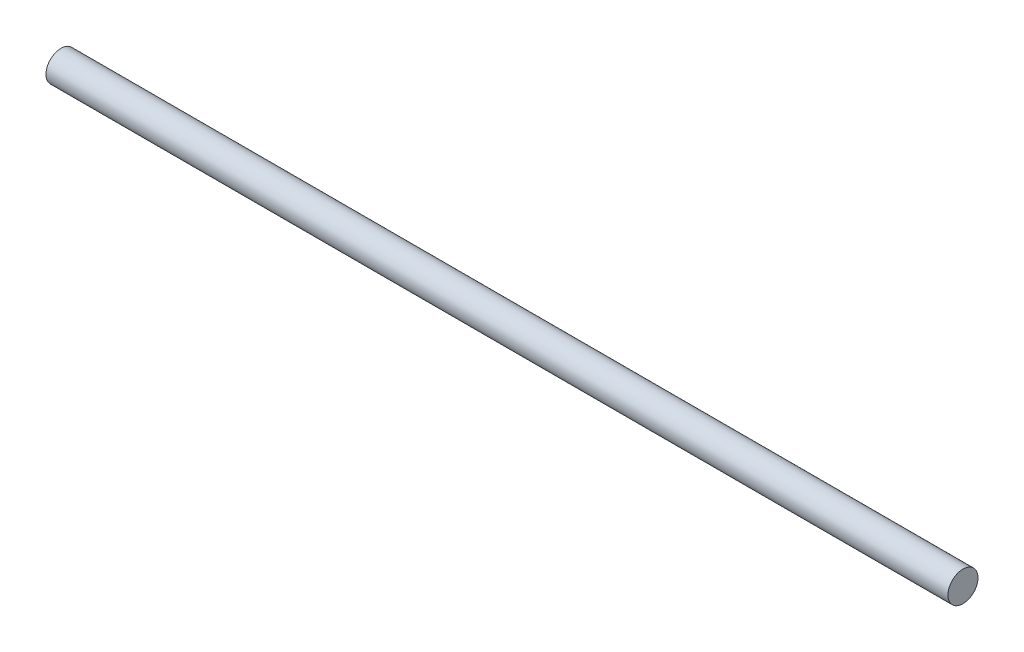
ISO-10303-21;
HEADER;
FILE_DESCRIPTION(('STEP AP214'),'2;1');
FILE_NAME('part.step','',(''),(''),'','','');
FILE_SCHEMA(('AUTOMOTIVE_DESIGN { 1 0 10303 214 1 1 1 1 }'));
ENDSEC;
DATA;
#1=APPLICATION_CONTEXT('core data for automotive mechanical design processes');
#2=APPLICATION_PROTOCOL_DEFINITION('international standard','automotive_design',2000,#1);
#3=PRODUCT_CONTEXT('',#1,'mechanical');
#4=PRODUCT('Part','Part','',(#3));
#5=PRODUCT_RELATED_PRODUCT_CATEGORY('part','',(#4));
#6=PRODUCT_DEFINITION_FORMATION('','',#4);
#7=PRODUCT_DEFINITION_CONTEXT('part definition',#1,'design');
#8=PRODUCT_DEFINITION('design','',#6,#7);
#9=PRODUCT_DEFINITION_SHAPE('','',#8);
#10=(LENGTH_UNIT() NAMED_UNIT(*) SI_UNIT(.MILLI.,.METRE.));
#11=(NAMED_UNIT(*) PLANE_ANGLE_UNIT() SI_UNIT($,.RADIAN.));
#12=(NAMED_UNIT(*) SI_UNIT($,.STERADIAN.) SOLID_ANGLE_UNIT());
#13=UNCERTAINTY_MEASURE_WITH_UNIT(LENGTH_MEASURE(1.E-05),#10,'distance_accuracy_value','');
#14=(GEOMETRIC_REPRESENTATION_CONTEXT(3) GLOBAL_UNCERTAINTY_ASSIGNED_CONTEXT((#13)) GLOBAL_UNIT_ASSIGNED_CONTEXT((#10,
#11,#12)) REPRESENTATION_CONTEXT('',''));
#15=CARTESIAN_POINT('',(0.,0.,0.));
#16=DIRECTION('',(0.,0.,1.));
#17=DIRECTION('',(1.,0.,0.));
#18=AXIS2_PLACEMENT_3D('',#15,#16,#17);
#19=CARTESIAN_POINT('',(571.5,0.,0.));
#20=DIRECTION('',(-1.,0.,0.));
#21=DIRECTION('',(0.,0.,1.));
#22=AXIS2_PLACEMENT_3D('',#19,#20,#21);
#23=CYLINDRICAL_SURFACE('',#22,9.525);
#24=CARTESIAN_POINT('',(571.5,0.,0.));
#25=DIRECTION('',(1.,0.,0.));
#26=DIRECTION('',(0.,0.,-1.));
#27=AXIS2_PLACEMENT_3D('',#24,#25,#26);
#28=CIRCLE('',#27,9.525);
#29=CARTESIAN_POINT('',(571.5,0.,-9.525));
#30=VERTEX_POINT('',#29);
#31=EDGE_CURVE('E10',#30,#30,#28,.T.);
#32=ORIENTED_EDGE('',*,*,#31,.F.);
#33=EDGE_LOOP('',(#32));
#34=FACE_BOUND('',#33,.T.);
#35=CARTESIAN_POINT('',(0.,0.,0.));
#36=DIRECTION('',(1.,0.,0.));
#37=DIRECTION('',(0.,0.,-1.));
#38=AXIS2_PLACEMENT_3D('',#35,#36,#37);
#39=CIRCLE('',#38,9.525);
#40=CARTESIAN_POINT('',(0.,0.,-9.525));
#41=VERTEX_POINT('',#40);
#42=EDGE_CURVE('E38',#41,#41,#39,.T.);
#43=ORIENTED_EDGE('',*,*,#42,.T.);
#44=EDGE_LOOP('',(#43));
#45=FACE_BOUND('',#44,.T.);
#46=ADVANCED_FACE('F35',(#34,#45),#23,.T.);
#47=CARTESIAN_POINT('',(571.5,0.,0.));
#48=DIRECTION('',(1.,0.,0.));
#49=DIRECTION('',(0.,0.,-1.));
#50=AXIS2_PLACEMENT_3D('',#47,#48,#49);
#51=PLANE('',#50);
#52=ORIENTED_EDGE('',*,*,#31,.T.);
#53=EDGE_LOOP('',(#52));
#54=FACE_BOUND('',#53,.T.);
#55=ADVANCED_FACE('F52',(#54),#51,.T.);
#56=CARTESIAN_POINT('',(0.,0.,0.));
#57=DIRECTION('',(1.,0.,0.));
#58=DIRECTION('',(0.,0.,-1.));
#59=AXIS2_PLACEMENT_3D('',#56,#57,#58);
#60=PLANE('',#59);
#61=ORIENTED_EDGE('',*,*,#42,.F.);
#62=EDGE_LOOP('',(#61));
#63=FACE_BOUND('',#62,.T.);
#64=ADVANCED_FACE('F50',(#63),#60,.F.);
#65=CLOSED_SHELL('',(#46,#55,#64));
#66=MANIFOLD_SOLID_BREP('B2',#65);
#67=ADVANCED_BREP_SHAPE_REPRESENTATION('',(#18,#66),#14);
#68=SHAPE_DEFINITION_REPRESENTATION(#9,#67);
ENDSEC;
END-ISO-10303-21;
